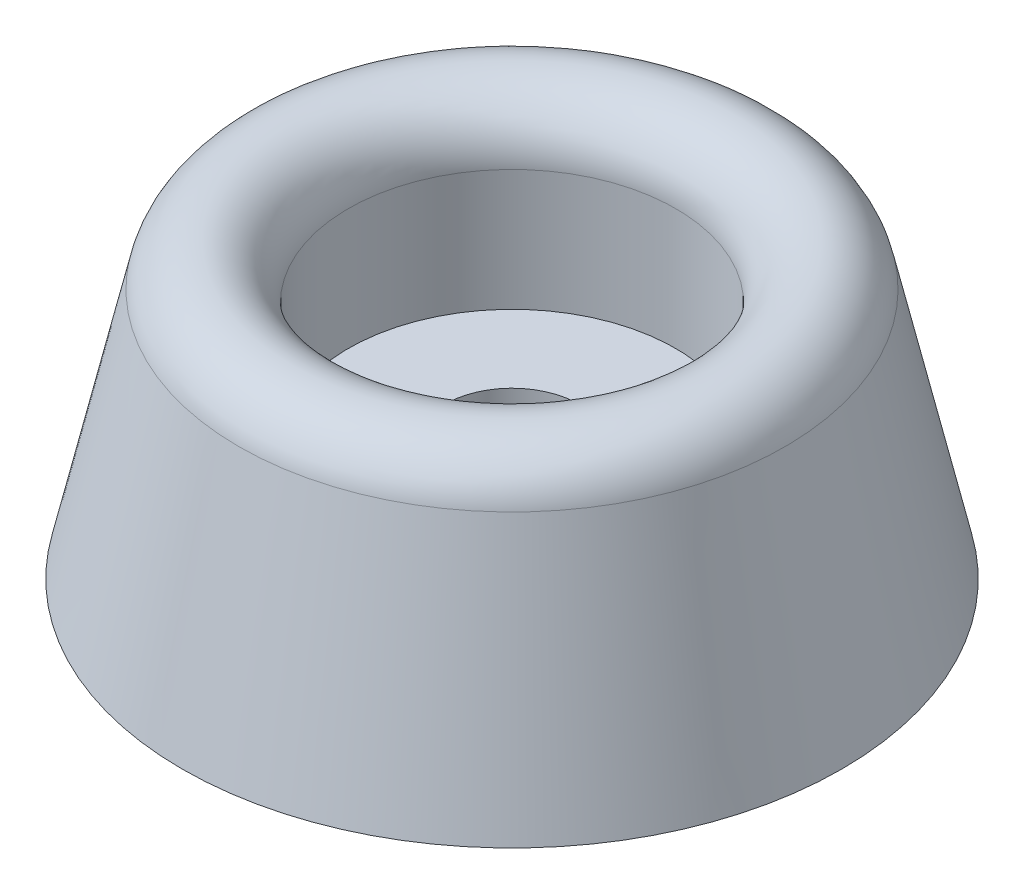
ISO-10303-21;
HEADER;
FILE_DESCRIPTION(('STEP AP214'),'2;1');
FILE_NAME('part.step','',(''),(''),'','','');
FILE_SCHEMA(('AUTOMOTIVE_DESIGN { 1 0 10303 214 1 1 1 1 }'));
ENDSEC;
DATA;
#1=APPLICATION_CONTEXT('core data for automotive mechanical design processes');
#2=APPLICATION_PROTOCOL_DEFINITION('international standard','automotive_design',2000,#1);
#3=PRODUCT_CONTEXT('',#1,'mechanical');
#4=PRODUCT('Part','Part','',(#3));
#5=PRODUCT_RELATED_PRODUCT_CATEGORY('part','',(#4));
#6=PRODUCT_DEFINITION_FORMATION('','',#4);
#7=PRODUCT_DEFINITION_CONTEXT('part definition',#1,'design');
#8=PRODUCT_DEFINITION('design','',#6,#7);
#9=PRODUCT_DEFINITION_SHAPE('','',#8);
#10=(LENGTH_UNIT() NAMED_UNIT(*) SI_UNIT(.MILLI.,.METRE.));
#11=(NAMED_UNIT(*) PLANE_ANGLE_UNIT() SI_UNIT($,.RADIAN.));
#12=(NAMED_UNIT(*) SI_UNIT($,.STERADIAN.) SOLID_ANGLE_UNIT());
#13=UNCERTAINTY_MEASURE_WITH_UNIT(LENGTH_MEASURE(1.E-05),#10,'distance_accuracy_value','');
#14=(GEOMETRIC_REPRESENTATION_CONTEXT(3) GLOBAL_UNCERTAINTY_ASSIGNED_CONTEXT((#13)) GLOBAL_UNIT_ASSIGNED_CONTEXT((#10,
#11,#12)) REPRESENTATION_CONTEXT('',''));
#15=CARTESIAN_POINT('',(0.,0.,0.));
#16=DIRECTION('',(0.,0.,1.));
#17=DIRECTION('',(1.,0.,0.));
#18=AXIS2_PLACEMENT_3D('',#15,#16,#17);
#19=CARTESIAN_POINT('',(7.84999998867595,-2.55902937729147E-09,0.));
#20=DIRECTION('',(0.,-1.,0.));
#21=DIRECTION('',(0.,0.,-1.));
#22=AXIS2_PLACEMENT_3D('',#19,#20,#21);
#23=PLANE('',#22);
#24=CARTESIAN_POINT('',(0.,-2.55902937729147E-09,0.));
#25=DIRECTION('',(0.,1.,0.));
#26=DIRECTION('',(0.,0.,1.));
#27=AXIS2_PLACEMENT_3D('',#24,#25,#26);
#28=CIRCLE('',#27,1.6);
#29=CARTESIAN_POINT('',(0.,-2.55902937729147E-09,1.6));
#30=VERTEX_POINT('',#29);
#31=EDGE_CURVE('E10',#30,#30,#28,.T.);
#32=ORIENTED_EDGE('',*,*,#31,.T.);
#33=EDGE_LOOP('',(#32));
#34=FACE_BOUND('',#33,.T.);
#35=CARTESIAN_POINT('',(0.,-2.55902937729147E-09,0.));
#36=DIRECTION('',(0.,1.,0.));
#37=DIRECTION('',(0.,0.,1.));
#38=AXIS2_PLACEMENT_3D('',#35,#36,#37);
#39=CIRCLE('',#38,7.84999998867595);
#40=CARTESIAN_POINT('',(0.,-2.55902937729147E-09,7.84999998867595));
#41=VERTEX_POINT('',#40);
#42=EDGE_CURVE('E52',#41,#41,#39,.T.);
#43=ORIENTED_EDGE('',*,*,#42,.F.);
#44=EDGE_LOOP('',(#43));
#45=FACE_BOUND('',#44,.T.);
#46=ADVANCED_FACE('F30',(#34,#45),#23,.T.);
#47=CARTESIAN_POINT('',(0.,-2.55902937729147E-09,0.));
#48=DIRECTION('',(0.,1.,0.));
#49=DIRECTION('',(0.,0.,1.));
#50=AXIS2_PLACEMENT_3D('',#47,#48,#49);
#51=CYLINDRICAL_SURFACE('',#50,1.6);
#52=CARTESIAN_POINT('',(0.,2.8,0.));
#53=DIRECTION('',(0.,1.,0.));
#54=DIRECTION('',(0.,0.,1.));
#55=AXIS2_PLACEMENT_3D('',#52,#53,#54);
#56=CIRCLE('',#55,1.6);
#57=CARTESIAN_POINT('',(0.,2.8,1.6));
#58=VERTEX_POINT('',#57);
#59=EDGE_CURVE('E36',#58,#58,#56,.T.);
#60=ORIENTED_EDGE('',*,*,#59,.T.);
#61=EDGE_LOOP('',(#60));
#62=FACE_BOUND('',#61,.T.);
#63=ORIENTED_EDGE('',*,*,#31,.F.);
#64=EDGE_LOOP('',(#63));
#65=FACE_BOUND('',#64,.T.);
#66=ADVANCED_FACE('F60',(#62,#65),#51,.F.);
#67=CARTESIAN_POINT('',(1.6,2.8,0.));
#68=DIRECTION('',(0.,1.,0.));
#69=DIRECTION('',(0.,0.,1.));
#70=AXIS2_PLACEMENT_3D('',#67,#68,#69);
#71=PLANE('',#70);
#72=CARTESIAN_POINT('',(0.,2.8,0.));
#73=DIRECTION('',(0.,1.,0.));
#74=DIRECTION('',(0.,0.,1.));
#75=AXIS2_PLACEMENT_3D('',#72,#73,#74);
#76=CIRCLE('',#75,3.9);
#77=CARTESIAN_POINT('',(0.,2.8,3.9));
#78=VERTEX_POINT('',#77);
#79=EDGE_CURVE('E40',#78,#78,#76,.T.);
#80=ORIENTED_EDGE('',*,*,#79,.T.);
#81=EDGE_LOOP('',(#80));
#82=FACE_BOUND('',#81,.T.);
#83=ORIENTED_EDGE('',*,*,#59,.F.);
#84=EDGE_LOOP('',(#83));
#85=FACE_BOUND('',#84,.T.);
#86=ADVANCED_FACE('F64',(#82,#85),#71,.T.);
#87=CARTESIAN_POINT('',(0.,-2.55902937729147E-09,0.));
#88=DIRECTION('',(0.,1.,0.));
#89=DIRECTION('',(0.,0.,1.));
#90=AXIS2_PLACEMENT_3D('',#87,#88,#89);
#91=CYLINDRICAL_SURFACE('',#90,3.9);
#92=CARTESIAN_POINT('',(0.,5.68381369871044,0.));
#93=DIRECTION('',(0.,1.,0.));
#94=DIRECTION('',(0.,0.,1.));
#95=AXIS2_PLACEMENT_3D('',#92,#93,#94);
#96=CIRCLE('',#95,3.9);
#97=CARTESIAN_POINT('',(0.,5.68381369871044,3.9));
#98=VERTEX_POINT('',#97);
#99=EDGE_CURVE('E44',#98,#98,#96,.T.);
#100=ORIENTED_EDGE('',*,*,#99,.T.);
#101=EDGE_LOOP('',(#100));
#102=FACE_BOUND('',#101,.T.);
#103=ORIENTED_EDGE('',*,*,#79,.F.);
#104=EDGE_LOOP('',(#103));
#105=FACE_BOUND('',#104,.T.);
#106=ADVANCED_FACE('F68',(#102,#105),#91,.F.);
#107=CARTESIAN_POINT('',(0.,5.68381369871044,0.));
#108=DIRECTION('',(0.,1.,0.));
#109=DIRECTION('',(0.,0.,1.));
#110=AXIS2_PLACEMENT_3D('',#107,#108,#109);
#111=TOROIDAL_SURFACE('',#110,5.21618630128956,1.31618630128956);
#112=CARTESIAN_POINT('',(0.,5.97393223533587,0.));
#113=DIRECTION('',(0.,1.,0.));
#114=DIRECTION('',(0.,0.,1.));
#115=AXIS2_PLACEMENT_3D('',#112,#113,#114);
#116=CIRCLE('',#115,6.50000000054994);
#117=CARTESIAN_POINT('',(0.,5.97393223533587,6.50000000054994));
#118=VERTEX_POINT('',#117);
#119=EDGE_CURVE('E49',#118,#118,#116,.T.);
#120=ORIENTED_EDGE('',*,*,#119,.T.);
#121=EDGE_LOOP('',(#120));
#122=FACE_BOUND('',#121,.T.);
#123=ORIENTED_EDGE('',*,*,#99,.F.);
#124=EDGE_LOOP('',(#123));
#125=FACE_BOUND('',#124,.T.);
#126=ADVANCED_FACE('F75',(#122,#125),#111,.T.);
#127=CARTESIAN_POINT('',(0.,5.97393223533587,0.));
#128=DIRECTION('',(0.,-1.,0.));
#129=DIRECTION('',(0.,0.,-1.));
#130=AXIS2_PLACEMENT_3D('',#127,#128,#129);
#131=CONICAL_SURFACE('',#130,6.50000000054994,0.222248741452664);
#132=ORIENTED_EDGE('',*,*,#42,.T.);
#133=EDGE_LOOP('',(#132));
#134=FACE_BOUND('',#133,.T.);
#135=ORIENTED_EDGE('',*,*,#119,.F.);
#136=EDGE_LOOP('',(#135));
#137=FACE_BOUND('',#136,.T.);
#138=ADVANCED_FACE('F56',(#134,#137),#131,.T.);
#139=CLOSED_SHELL('',(#46,#66,#86,#106,#126,#138));
#140=MANIFOLD_SOLID_BREP('B2',#139);
#141=ADVANCED_BREP_SHAPE_REPRESENTATION('',(#18,#140),#14);
#142=SHAPE_DEFINITION_REPRESENTATION(#9,#141);
ENDSEC;
END-ISO-10303-21;
